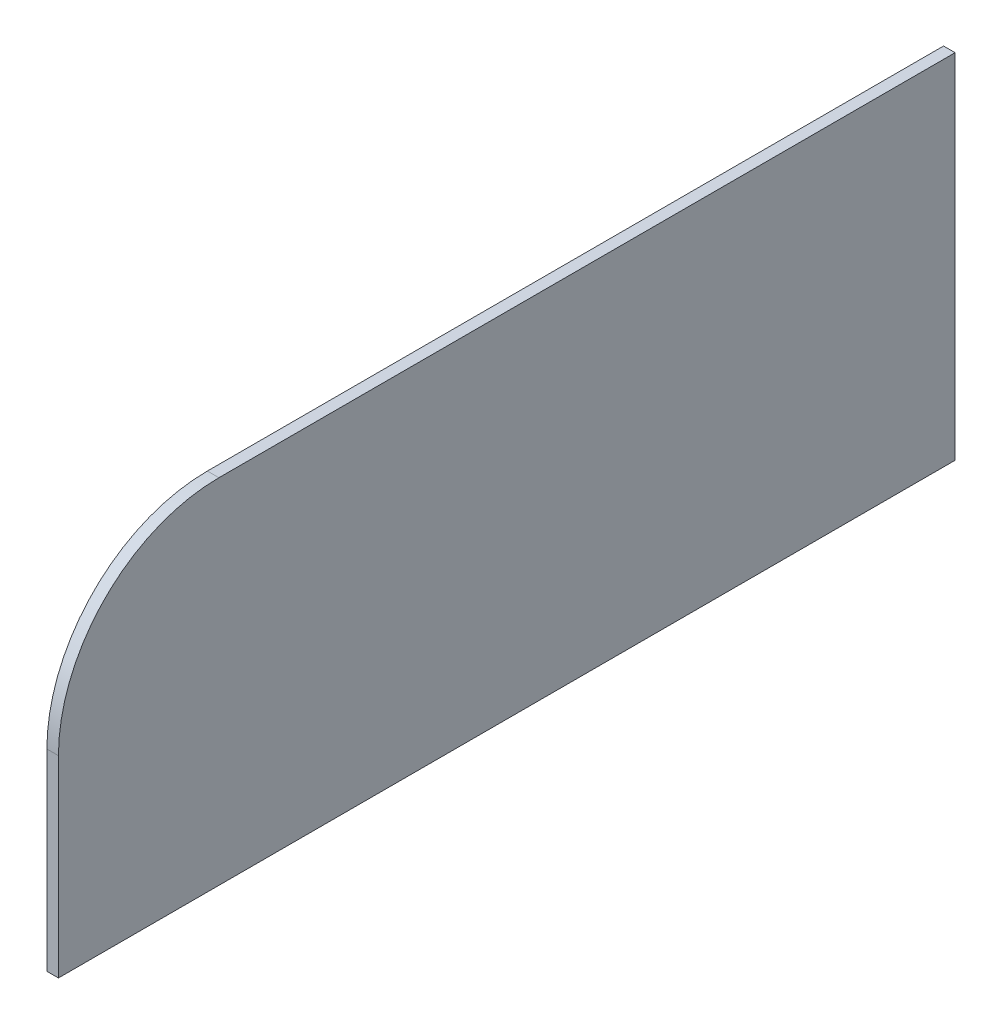
ISO-10303-21;
HEADER;
FILE_DESCRIPTION(('STEP AP214'),'2;1');
FILE_NAME('part.step','',(''),(''),'','','');
FILE_SCHEMA(('AUTOMOTIVE_DESIGN { 1 0 10303 214 1 1 1 1 }'));
ENDSEC;
DATA;
#1=APPLICATION_CONTEXT('core data for automotive mechanical design processes');
#2=APPLICATION_PROTOCOL_DEFINITION('international standard','automotive_design',2000,#1);
#3=PRODUCT_CONTEXT('',#1,'mechanical');
#4=PRODUCT('Part','Part','',(#3));
#5=PRODUCT_RELATED_PRODUCT_CATEGORY('part','',(#4));
#6=PRODUCT_DEFINITION_FORMATION('','',#4);
#7=PRODUCT_DEFINITION_CONTEXT('part definition',#1,'design');
#8=PRODUCT_DEFINITION('design','',#6,#7);
#9=PRODUCT_DEFINITION_SHAPE('','',#8);
#10=(LENGTH_UNIT() NAMED_UNIT(*) SI_UNIT(.MILLI.,.METRE.));
#11=(NAMED_UNIT(*) PLANE_ANGLE_UNIT() SI_UNIT($,.RADIAN.));
#12=(NAMED_UNIT(*) SI_UNIT($,.STERADIAN.) SOLID_ANGLE_UNIT());
#13=UNCERTAINTY_MEASURE_WITH_UNIT(LENGTH_MEASURE(1.E-05),#10,'distance_accuracy_value','');
#14=(GEOMETRIC_REPRESENTATION_CONTEXT(3) GLOBAL_UNCERTAINTY_ASSIGNED_CONTEXT((#13)) GLOBAL_UNIT_ASSIGNED_CONTEXT((#10,
#11,#12)) REPRESENTATION_CONTEXT('',''));
#15=CARTESIAN_POINT('',(0.,0.,0.));
#16=DIRECTION('',(0.,0.,1.));
#17=DIRECTION('',(1.,0.,0.));
#18=AXIS2_PLACEMENT_3D('',#15,#16,#17);
#19=CARTESIAN_POINT('',(18.,-492.219556499024,-1129.39206681115));
#20=DIRECTION('',(0.,0.,1.));
#21=DIRECTION('',(1.,0.,0.));
#22=AXIS2_PLACEMENT_3D('',#19,#20,#21);
#23=PLANE('',#22);
#24=DIRECTION('',(0.,1.,0.));
#25=VECTOR('',#24,1.);
#26=CARTESIAN_POINT('',(0.,-492.219556499024,-1129.39206681115));
#27=LINE('',#26,#25);
#28=CARTESIAN_POINT('',(0.,-492.219556499024,-1129.39206681115));
#29=VERTEX_POINT('',#28);
#30=CARTESIAN_POINT('',(0.,57.7804435009757,-1129.39206681115));
#31=VERTEX_POINT('',#30);
#32=EDGE_CURVE('E107',#29,#31,#27,.T.);
#33=ORIENTED_EDGE('',*,*,#32,.T.);
#34=DIRECTION('',(-1.,0.,0.));
#35=VECTOR('',#34,1.);
#36=CARTESIAN_POINT('',(18.,57.7804435009757,-1129.39206681115));
#37=LINE('',#36,#35);
#38=CARTESIAN_POINT('',(18.,57.7804435009757,-1129.39206681115));
#39=VERTEX_POINT('',#38);
#40=EDGE_CURVE('E11',#39,#31,#37,.T.);
#41=ORIENTED_EDGE('',*,*,#40,.F.);
#42=DIRECTION('',(0.,1.,0.));
#43=VECTOR('',#42,1.);
#44=CARTESIAN_POINT('',(18.,-492.219556499024,-1129.39206681115));
#45=LINE('',#44,#43);
#46=CARTESIAN_POINT('',(18.,-492.219556499024,-1129.39206681115));
#47=VERTEX_POINT('',#46);
#48=EDGE_CURVE('E115',#47,#39,#45,.T.);
#49=ORIENTED_EDGE('',*,*,#48,.F.);
#50=DIRECTION('',(-1.,0.,0.));
#51=VECTOR('',#50,1.);
#52=CARTESIAN_POINT('',(18.,-492.219556499024,-1129.39206681115));
#53=LINE('',#52,#51);
#54=EDGE_CURVE('E103',#47,#29,#53,.T.);
#55=ORIENTED_EDGE('',*,*,#54,.T.);
#56=EDGE_LOOP('',(#33,#41,#49,#55));
#57=FACE_BOUND('',#56,.T.);
#58=ADVANCED_FACE('F33',(#57),#23,.F.);
#59=CARTESIAN_POINT('',(18.,57.7804435009757,-1129.39206681115));
#60=DIRECTION('',(0.,-1.,0.));
#61=DIRECTION('',(0.,0.,-1.));
#62=AXIS2_PLACEMENT_3D('',#59,#60,#61);
#63=PLANE('',#62);
#64=DIRECTION('',(0.,0.,1.));
#65=VECTOR('',#64,1.);
#66=CARTESIAN_POINT('',(0.,57.7804435009757,-1129.39206681115));
#67=LINE('',#66,#65);
#68=CARTESIAN_POINT('',(0.,57.7804435009756,17.6079331888453));
#69=VERTEX_POINT('',#68);
#70=EDGE_CURVE('E110',#31,#69,#67,.T.);
#71=ORIENTED_EDGE('',*,*,#70,.T.);
#72=DIRECTION('',(-1.,0.,0.));
#73=VECTOR('',#72,1.);
#74=CARTESIAN_POINT('',(18.,57.7804435009756,17.6079331888453));
#75=LINE('',#74,#73);
#76=CARTESIAN_POINT('',(18.,57.7804435009756,17.6079331888453));
#77=VERTEX_POINT('',#76);
#78=EDGE_CURVE('E41',#77,#69,#75,.T.);
#79=ORIENTED_EDGE('',*,*,#78,.F.);
#80=DIRECTION('',(0.,0.,1.));
#81=VECTOR('',#80,1.);
#82=CARTESIAN_POINT('',(18.,57.7804435009757,-1129.39206681115));
#83=LINE('',#82,#81);
#84=EDGE_CURVE('E83',#39,#77,#83,.T.);
#85=ORIENTED_EDGE('',*,*,#84,.F.);
#86=ORIENTED_EDGE('',*,*,#40,.T.);
#87=EDGE_LOOP('',(#71,#79,#85,#86));
#88=FACE_BOUND('',#87,.T.);
#89=ADVANCED_FACE('F134',(#88),#63,.F.);
#90=CARTESIAN_POINT('',(18.,-192.219556499024,17.607933188847));
#91=DIRECTION('',(-1.,0.,0.));
#92=DIRECTION('',(0.,0.,1.));
#93=AXIS2_PLACEMENT_3D('',#90,#91,#92);
#94=CYLINDRICAL_SURFACE('',#93,250.);
#95=CARTESIAN_POINT('',(0.,-192.219556499024,17.607933188847));
#96=DIRECTION('',(1.,0.,0.));
#97=DIRECTION('',(0.,0.,1.));
#98=AXIS2_PLACEMENT_3D('',#95,#96,#97);
#99=CIRCLE('',#98,250.);
#100=CARTESIAN_POINT('',(0.,-192.219556499026,267.607933188847));
#101=VERTEX_POINT('',#100);
#102=EDGE_CURVE('E98',#69,#101,#99,.T.);
#103=ORIENTED_EDGE('',*,*,#102,.T.);
#104=DIRECTION('',(-1.,0.,0.));
#105=VECTOR('',#104,1.);
#106=CARTESIAN_POINT('',(18.,-192.219556499026,267.607933188847));
#107=LINE('',#106,#105);
#108=CARTESIAN_POINT('',(18.,-192.219556499026,267.607933188847));
#109=VERTEX_POINT('',#108);
#110=EDGE_CURVE('E95',#109,#101,#107,.T.);
#111=ORIENTED_EDGE('',*,*,#110,.F.);
#112=CARTESIAN_POINT('',(18.,-192.219556499024,17.607933188847));
#113=DIRECTION('',(1.,0.,0.));
#114=DIRECTION('',(0.,0.,1.));
#115=AXIS2_PLACEMENT_3D('',#112,#113,#114);
#116=CIRCLE('',#115,250.);
#117=EDGE_CURVE('E87',#77,#109,#116,.T.);
#118=ORIENTED_EDGE('',*,*,#117,.F.);
#119=ORIENTED_EDGE('',*,*,#78,.T.);
#120=EDGE_LOOP('',(#103,#111,#118,#119));
#121=FACE_BOUND('',#120,.T.);
#122=ADVANCED_FACE('F96',(#121),#94,.T.);
#123=CARTESIAN_POINT('',(18.,-492.219556499024,267.607933188847));
#124=DIRECTION('',(0.,0.,-1.));
#125=DIRECTION('',(-1.,0.,0.));
#126=AXIS2_PLACEMENT_3D('',#123,#124,#125);
#127=PLANE('',#126);
#128=DIRECTION('',(0.,-1.,0.));
#129=VECTOR('',#128,1.);
#130=CARTESIAN_POINT('',(0.,-492.219556499024,267.607933188847));
#131=LINE('',#130,#129);
#132=CARTESIAN_POINT('',(0.,-492.219556499024,267.607933188847));
#133=VERTEX_POINT('',#132);
#134=EDGE_CURVE('E69',#101,#133,#131,.T.);
#135=ORIENTED_EDGE('',*,*,#134,.T.);
#136=DIRECTION('',(-1.,0.,0.));
#137=VECTOR('',#136,1.);
#138=CARTESIAN_POINT('',(18.,-492.219556499024,267.607933188847));
#139=LINE('',#138,#137);
#140=CARTESIAN_POINT('',(18.,-492.219556499024,267.607933188847));
#141=VERTEX_POINT('',#140);
#142=EDGE_CURVE('E99',#141,#133,#139,.T.);
#143=ORIENTED_EDGE('',*,*,#142,.F.);
#144=DIRECTION('',(0.,-1.,0.));
#145=VECTOR('',#144,1.);
#146=CARTESIAN_POINT('',(18.,-492.219556499024,267.607933188847));
#147=LINE('',#146,#145);
#148=EDGE_CURVE('E91',#109,#141,#147,.T.);
#149=ORIENTED_EDGE('',*,*,#148,.F.);
#150=ORIENTED_EDGE('',*,*,#110,.T.);
#151=EDGE_LOOP('',(#135,#143,#149,#150));
#152=FACE_BOUND('',#151,.T.);
#153=ADVANCED_FACE('F101',(#152),#127,.F.);
#154=CARTESIAN_POINT('',(18.,-492.219556499024,-1129.39206681115));
#155=DIRECTION('',(0.,1.,0.));
#156=DIRECTION('',(0.,0.,1.));
#157=AXIS2_PLACEMENT_3D('',#154,#155,#156);
#158=PLANE('',#157);
#159=DIRECTION('',(0.,0.,-1.));
#160=VECTOR('',#159,1.);
#161=CARTESIAN_POINT('',(0.,-492.219556499024,-1129.39206681115));
#162=LINE('',#161,#160);
#163=EDGE_CURVE('E75',#133,#29,#162,.T.);
#164=ORIENTED_EDGE('',*,*,#163,.T.);
#165=ORIENTED_EDGE('',*,*,#54,.F.);
#166=DIRECTION('',(0.,0.,-1.));
#167=VECTOR('',#166,1.);
#168=CARTESIAN_POINT('',(18.,-492.219556499024,-1129.39206681115));
#169=LINE('',#168,#167);
#170=EDGE_CURVE('E49',#141,#47,#169,.T.);
#171=ORIENTED_EDGE('',*,*,#170,.F.);
#172=ORIENTED_EDGE('',*,*,#142,.T.);
#173=EDGE_LOOP('',(#164,#165,#171,#172));
#174=FACE_BOUND('',#173,.T.);
#175=ADVANCED_FACE('F123',(#174),#158,.F.);
#176=CARTESIAN_POINT('',(18.,-192.219556499024,17.607933188847));
#177=DIRECTION('',(-1.,0.,0.));
#178=DIRECTION('',(0.,0.,1.));
#179=AXIS2_PLACEMENT_3D('',#176,#177,#178);
#180=PLANE('',#179);
#181=ORIENTED_EDGE('',*,*,#48,.T.);
#182=ORIENTED_EDGE('',*,*,#84,.T.);
#183=ORIENTED_EDGE('',*,*,#117,.T.);
#184=ORIENTED_EDGE('',*,*,#148,.T.);
#185=ORIENTED_EDGE('',*,*,#170,.T.);
#186=EDGE_LOOP('',(#181,#182,#183,#184,#185));
#187=FACE_BOUND('',#186,.T.);
#188=ADVANCED_FACE('F89',(#187),#180,.F.);
#189=CARTESIAN_POINT('',(0.,-192.219556499024,17.607933188847));
#190=DIRECTION('',(-1.,0.,0.));
#191=DIRECTION('',(0.,0.,1.));
#192=AXIS2_PLACEMENT_3D('',#189,#190,#191);
#193=PLANE('',#192);
#194=ORIENTED_EDGE('',*,*,#32,.F.);
#195=ORIENTED_EDGE('',*,*,#163,.F.);
#196=ORIENTED_EDGE('',*,*,#134,.F.);
#197=ORIENTED_EDGE('',*,*,#102,.F.);
#198=ORIENTED_EDGE('',*,*,#70,.F.);
#199=EDGE_LOOP('',(#194,#195,#196,#197,#198));
#200=FACE_BOUND('',#199,.T.);
#201=ADVANCED_FACE('F119',(#200),#193,.T.);
#202=CLOSED_SHELL('',(#58,#89,#122,#153,#175,#188,#201));
#203=MANIFOLD_SOLID_BREP('B2',#202);
#204=ADVANCED_BREP_SHAPE_REPRESENTATION('',(#18,#203),#14);
#205=SHAPE_DEFINITION_REPRESENTATION(#9,#204);
ENDSEC;
END-ISO-10303-21;
